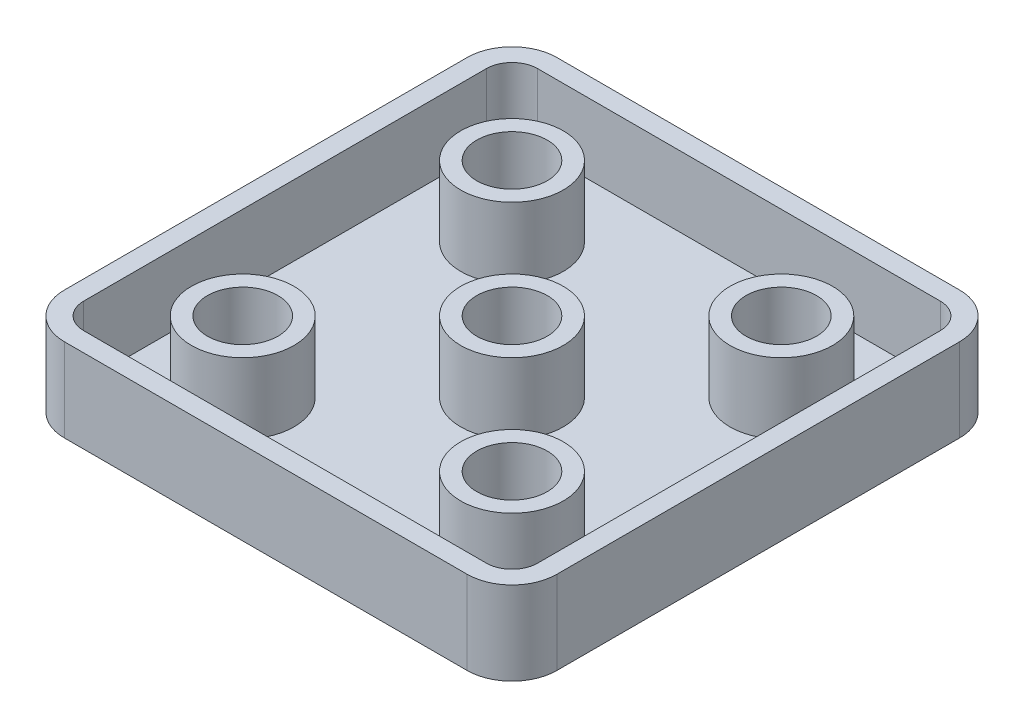
ISO-10303-21;
HEADER;
FILE_DESCRIPTION(('STEP AP214'),'2;1');
FILE_NAME('part.step','',(''),(''),'','','');
FILE_SCHEMA(('AUTOMOTIVE_DESIGN { 1 0 10303 214 1 1 1 1 }'));
ENDSEC;
DATA;
#1=APPLICATION_CONTEXT('core data for automotive mechanical design processes');
#2=APPLICATION_PROTOCOL_DEFINITION('international standard','automotive_design',2000,#1);
#3=PRODUCT_CONTEXT('',#1,'mechanical');
#4=PRODUCT('Part','Part','',(#3));
#5=PRODUCT_RELATED_PRODUCT_CATEGORY('part','',(#4));
#6=PRODUCT_DEFINITION_FORMATION('','',#4);
#7=PRODUCT_DEFINITION_CONTEXT('part definition',#1,'design');
#8=PRODUCT_DEFINITION('design','',#6,#7);
#9=PRODUCT_DEFINITION_SHAPE('','',#8);
#10=(LENGTH_UNIT() NAMED_UNIT(*) SI_UNIT(.MILLI.,.METRE.));
#11=(NAMED_UNIT(*) PLANE_ANGLE_UNIT() SI_UNIT($,.RADIAN.));
#12=(NAMED_UNIT(*) SI_UNIT($,.STERADIAN.) SOLID_ANGLE_UNIT());
#13=UNCERTAINTY_MEASURE_WITH_UNIT(LENGTH_MEASURE(1.E-05),#10,'distance_accuracy_value','');
#14=(GEOMETRIC_REPRESENTATION_CONTEXT(3) GLOBAL_UNCERTAINTY_ASSIGNED_CONTEXT((#13)) GLOBAL_UNIT_ASSIGNED_CONTEXT((#10,
#11,#12)) REPRESENTATION_CONTEXT('',''));
#15=CARTESIAN_POINT('',(0.,0.,0.));
#16=DIRECTION('',(0.,0.,1.));
#17=DIRECTION('',(1.,0.,0.));
#18=AXIS2_PLACEMENT_3D('',#15,#16,#17);
#19=CARTESIAN_POINT('',(0.,6.5,0.));
#20=DIRECTION('',(-1.,0.,0.));
#21=DIRECTION('',(0.,0.,1.));
#22=AXIS2_PLACEMENT_3D('',#19,#20,#21);
#23=PLANE('',#22);
#24=DIRECTION('',(0.,0.,-1.));
#25=VECTOR('',#24,1.);
#26=CARTESIAN_POINT('',(0.,0.,0.));
#27=LINE('',#26,#25);
#28=CARTESIAN_POINT('',(0.,0.,34.9));
#29=VERTEX_POINT('',#28);
#30=CARTESIAN_POINT('',(0.,0.,3.5));
#31=VERTEX_POINT('',#30);
#32=EDGE_CURVE('E369',#29,#31,#27,.T.);
#33=ORIENTED_EDGE('',*,*,#32,.T.);
#34=DIRECTION('',(0.,-1.,0.));
#35=VECTOR('',#34,1.);
#36=CARTESIAN_POINT('',(0.,6.5,3.5));
#37=LINE('',#36,#35);
#38=CARTESIAN_POINT('',(0.,6.5,3.5));
#39=VERTEX_POINT('',#38);
#40=EDGE_CURVE('E12',#31,#39,#37,.F.);
#41=ORIENTED_EDGE('',*,*,#40,.T.);
#42=DIRECTION('',(0.,0.,-1.));
#43=VECTOR('',#42,1.);
#44=CARTESIAN_POINT('',(0.,6.5,0.));
#45=LINE('',#44,#43);
#46=CARTESIAN_POINT('',(0.,6.5,34.9));
#47=VERTEX_POINT('',#46);
#48=EDGE_CURVE('E383',#47,#39,#45,.T.);
#49=ORIENTED_EDGE('',*,*,#48,.F.);
#50=DIRECTION('',(0.,-1.,0.));
#51=VECTOR('',#50,1.);
#52=CARTESIAN_POINT('',(0.,6.5,34.9));
#53=LINE('',#52,#51);
#54=EDGE_CURVE('E183',#47,#29,#53,.T.);
#55=ORIENTED_EDGE('',*,*,#54,.T.);
#56=EDGE_LOOP('',(#33,#41,#49,#55));
#57=FACE_BOUND('',#56,.T.);
#58=ADVANCED_FACE('F175',(#57),#23,.F.);
#59=CARTESIAN_POINT('',(0.,6.5,0.));
#60=DIRECTION('',(0.,0.,1.));
#61=DIRECTION('',(1.,0.,0.));
#62=AXIS2_PLACEMENT_3D('',#59,#60,#61);
#63=PLANE('',#62);
#64=DIRECTION('',(-1.,0.,0.));
#65=VECTOR('',#64,1.);
#66=CARTESIAN_POINT('',(0.,0.,0.));
#67=LINE('',#66,#65);
#68=CARTESIAN_POINT('',(-3.5,0.,0.));
#69=VERTEX_POINT('',#68);
#70=CARTESIAN_POINT('',(-34.9,0.,0.));
#71=VERTEX_POINT('',#70);
#72=EDGE_CURVE('E398',#69,#71,#67,.T.);
#73=ORIENTED_EDGE('',*,*,#72,.T.);
#74=DIRECTION('',(0.,-1.,0.));
#75=VECTOR('',#74,1.);
#76=CARTESIAN_POINT('',(-34.9,6.5,0.));
#77=LINE('',#76,#75);
#78=CARTESIAN_POINT('',(-34.9,6.5,0.));
#79=VERTEX_POINT('',#78);
#80=EDGE_CURVE('E198',#71,#79,#77,.F.);
#81=ORIENTED_EDGE('',*,*,#80,.T.);
#82=DIRECTION('',(-1.,0.,0.));
#83=VECTOR('',#82,1.);
#84=CARTESIAN_POINT('',(0.,6.5,0.));
#85=LINE('',#84,#83);
#86=CARTESIAN_POINT('',(-3.5,6.5,0.));
#87=VERTEX_POINT('',#86);
#88=EDGE_CURVE('E386',#87,#79,#85,.T.);
#89=ORIENTED_EDGE('',*,*,#88,.F.);
#90=DIRECTION('',(0.,-1.,0.));
#91=VECTOR('',#90,1.);
#92=CARTESIAN_POINT('',(-3.5,6.5,0.));
#93=LINE('',#92,#91);
#94=EDGE_CURVE('E430',#87,#69,#93,.T.);
#95=ORIENTED_EDGE('',*,*,#94,.T.);
#96=EDGE_LOOP('',(#73,#81,#89,#95));
#97=FACE_BOUND('',#96,.T.);
#98=ADVANCED_FACE('F449',(#97),#63,.F.);
#99=CARTESIAN_POINT('',(-38.4,6.5,0.));
#100=DIRECTION('',(1.,0.,0.));
#101=DIRECTION('',(0.,0.,-1.));
#102=AXIS2_PLACEMENT_3D('',#99,#100,#101);
#103=PLANE('',#102);
#104=DIRECTION('',(0.,0.,1.));
#105=VECTOR('',#104,1.);
#106=CARTESIAN_POINT('',(-38.4,0.,0.));
#107=LINE('',#106,#105);
#108=CARTESIAN_POINT('',(-38.4,0.,3.5));
#109=VERTEX_POINT('',#108);
#110=CARTESIAN_POINT('',(-38.4,0.,34.9));
#111=VERTEX_POINT('',#110);
#112=EDGE_CURVE('E400',#109,#111,#107,.T.);
#113=ORIENTED_EDGE('',*,*,#112,.T.);
#114=DIRECTION('',(0.,-1.,0.));
#115=VECTOR('',#114,1.);
#116=CARTESIAN_POINT('',(-38.4,6.5,34.9));
#117=LINE('',#116,#115);
#118=CARTESIAN_POINT('',(-38.4,6.5,34.9));
#119=VERTEX_POINT('',#118);
#120=EDGE_CURVE('E420',#111,#119,#117,.F.);
#121=ORIENTED_EDGE('',*,*,#120,.T.);
#122=DIRECTION('',(0.,0.,1.));
#123=VECTOR('',#122,1.);
#124=CARTESIAN_POINT('',(-38.4,6.5,0.));
#125=LINE('',#124,#123);
#126=CARTESIAN_POINT('',(-38.4,6.5,3.5));
#127=VERTEX_POINT('',#126);
#128=EDGE_CURVE('E389',#127,#119,#125,.T.);
#129=ORIENTED_EDGE('',*,*,#128,.F.);
#130=DIRECTION('',(0.,-1.,0.));
#131=VECTOR('',#130,1.);
#132=CARTESIAN_POINT('',(-38.4,6.5,3.5));
#133=LINE('',#132,#131);
#134=EDGE_CURVE('E417',#127,#109,#133,.T.);
#135=ORIENTED_EDGE('',*,*,#134,.T.);
#136=EDGE_LOOP('',(#113,#121,#129,#135));
#137=FACE_BOUND('',#136,.T.);
#138=ADVANCED_FACE('F459',(#137),#103,.F.);
#139=CARTESIAN_POINT('',(0.,6.5,38.4));
#140=DIRECTION('',(0.,0.,-1.));
#141=DIRECTION('',(-1.,0.,0.));
#142=AXIS2_PLACEMENT_3D('',#139,#140,#141);
#143=PLANE('',#142);
#144=DIRECTION('',(1.,0.,0.));
#145=VECTOR('',#144,1.);
#146=CARTESIAN_POINT('',(0.,6.5,38.4));
#147=LINE('',#146,#145);
#148=CARTESIAN_POINT('',(-34.9,6.5,38.4));
#149=VERTEX_POINT('',#148);
#150=CARTESIAN_POINT('',(-3.49999999999999,6.5,38.4));
#151=VERTEX_POINT('',#150);
#152=EDGE_CURVE('E392',#149,#151,#147,.T.);
#153=ORIENTED_EDGE('',*,*,#152,.F.);
#154=DIRECTION('',(0.,-1.,0.));
#155=VECTOR('',#154,1.);
#156=CARTESIAN_POINT('',(-34.9,6.5,38.4));
#157=LINE('',#156,#155);
#158=CARTESIAN_POINT('',(-34.9,0.,38.4));
#159=VERTEX_POINT('',#158);
#160=EDGE_CURVE('E406',#149,#159,#157,.T.);
#161=ORIENTED_EDGE('',*,*,#160,.T.);
#162=DIRECTION('',(1.,0.,0.));
#163=VECTOR('',#162,1.);
#164=CARTESIAN_POINT('',(0.,0.,38.4));
#165=LINE('',#164,#163);
#166=CARTESIAN_POINT('',(-3.49999999999999,0.,38.4));
#167=VERTEX_POINT('',#166);
#168=EDGE_CURVE('E387',#159,#167,#165,.T.);
#169=ORIENTED_EDGE('',*,*,#168,.T.);
#170=DIRECTION('',(0.,-1.,0.));
#171=VECTOR('',#170,1.);
#172=CARTESIAN_POINT('',(-3.49999999999999,6.5,38.4));
#173=LINE('',#172,#171);
#174=EDGE_CURVE('E395',#167,#151,#173,.F.);
#175=ORIENTED_EDGE('',*,*,#174,.T.);
#176=EDGE_LOOP('',(#153,#161,#169,#175));
#177=FACE_BOUND('',#176,.T.);
#178=ADVANCED_FACE('F467',(#177),#143,.F.);
#179=CARTESIAN_POINT('',(0.,6.5,0.));
#180=DIRECTION('',(0.,-1.,0.));
#181=DIRECTION('',(0.,0.,-1.));
#182=AXIS2_PLACEMENT_3D('',#179,#180,#181);
#183=PLANE('',#182);
#184=CARTESIAN_POINT('',(-34.9,6.5,3.5));
#185=DIRECTION('',(0.,1.,0.));
#186=DIRECTION('',(0.,0.,1.));
#187=AXIS2_PLACEMENT_3D('',#184,#185,#186);
#188=CIRCLE('',#187,2.);
#189=CARTESIAN_POINT('',(-34.9,6.5,1.5));
#190=VERTEX_POINT('',#189);
#191=CARTESIAN_POINT('',(-36.9,6.5,3.5));
#192=VERTEX_POINT('',#191);
#193=EDGE_CURVE('E346',#190,#192,#188,.T.);
#194=ORIENTED_EDGE('',*,*,#193,.F.);
#195=DIRECTION('',(-1.,0.,0.));
#196=VECTOR('',#195,1.);
#197=CARTESIAN_POINT('',(0.,6.5,1.5));
#198=LINE('',#197,#196);
#199=CARTESIAN_POINT('',(-3.50000000000001,6.5,1.5));
#200=VERTEX_POINT('',#199);
#201=EDGE_CURVE('E190',#200,#190,#198,.T.);
#202=ORIENTED_EDGE('',*,*,#201,.F.);
#203=CARTESIAN_POINT('',(-3.5,6.5,3.5));
#204=DIRECTION('',(0.,1.,0.));
#205=DIRECTION('',(0.,0.,1.));
#206=AXIS2_PLACEMENT_3D('',#203,#204,#205);
#207=CIRCLE('',#206,2.);
#208=CARTESIAN_POINT('',(-1.5,6.5,3.50000000000001));
#209=VERTEX_POINT('',#208);
#210=EDGE_CURVE('E363',#209,#200,#207,.T.);
#211=ORIENTED_EDGE('',*,*,#210,.F.);
#212=DIRECTION('',(0.,0.,-1.));
#213=VECTOR('',#212,1.);
#214=CARTESIAN_POINT('',(-1.5,6.5,0.));
#215=LINE('',#214,#213);
#216=CARTESIAN_POINT('',(-1.5,6.5,34.9));
#217=VERTEX_POINT('',#216);
#218=EDGE_CURVE('E360',#217,#209,#215,.T.);
#219=ORIENTED_EDGE('',*,*,#218,.F.);
#220=CARTESIAN_POINT('',(-3.5,6.5,34.9));
#221=DIRECTION('',(0.,1.,0.));
#222=DIRECTION('',(0.,0.,1.));
#223=AXIS2_PLACEMENT_3D('',#220,#221,#222);
#224=CIRCLE('',#223,2.);
#225=CARTESIAN_POINT('',(-3.5,6.5,36.9));
#226=VERTEX_POINT('',#225);
#227=EDGE_CURVE('E357',#226,#217,#224,.T.);
#228=ORIENTED_EDGE('',*,*,#227,.F.);
#229=DIRECTION('',(-1.,0.,0.));
#230=VECTOR('',#229,1.);
#231=CARTESIAN_POINT('',(0.,6.5,36.9));
#232=LINE('',#231,#230);
#233=CARTESIAN_POINT('',(-34.9,6.5,36.9));
#234=VERTEX_POINT('',#233);
#235=EDGE_CURVE('E354',#226,#234,#232,.T.);
#236=ORIENTED_EDGE('',*,*,#235,.T.);
#237=CARTESIAN_POINT('',(-34.9,6.5,34.9));
#238=DIRECTION('',(0.,1.,0.));
#239=DIRECTION('',(0.,0.,1.));
#240=AXIS2_PLACEMENT_3D('',#237,#238,#239);
#241=CIRCLE('',#240,2.);
#242=CARTESIAN_POINT('',(-36.9,6.5,34.9));
#243=VERTEX_POINT('',#242);
#244=EDGE_CURVE('E351',#234,#243,#241,.F.);
#245=ORIENTED_EDGE('',*,*,#244,.T.);
#246=DIRECTION('',(0.,0.,-1.));
#247=VECTOR('',#246,1.);
#248=CARTESIAN_POINT('',(-36.9,6.5,0.));
#249=LINE('',#248,#247);
#250=EDGE_CURVE('E348',#243,#192,#249,.T.);
#251=ORIENTED_EDGE('',*,*,#250,.T.);
#252=EDGE_LOOP('',(#194,#202,#211,#219,#228,#236,#245,#251));
#253=FACE_BOUND('',#252,.T.);
#254=ORIENTED_EDGE('',*,*,#128,.T.);
#255=CARTESIAN_POINT('',(-34.9,6.5,34.9));
#256=DIRECTION('',(0.,-1.,0.));
#257=DIRECTION('',(0.,0.,-1.));
#258=AXIS2_PLACEMENT_3D('',#255,#256,#257);
#259=CIRCLE('',#258,3.5);
#260=EDGE_CURVE('E428',#119,#149,#259,.F.);
#261=ORIENTED_EDGE('',*,*,#260,.T.);
#262=ORIENTED_EDGE('',*,*,#152,.T.);
#263=CARTESIAN_POINT('',(-3.5,6.5,34.9));
#264=DIRECTION('',(0.,-1.,0.));
#265=DIRECTION('',(0.,0.,-1.));
#266=AXIS2_PLACEMENT_3D('',#263,#264,#265);
#267=CIRCLE('',#266,3.5);
#268=EDGE_CURVE('E422',#151,#47,#267,.F.);
#269=ORIENTED_EDGE('',*,*,#268,.T.);
#270=ORIENTED_EDGE('',*,*,#48,.T.);
#271=CARTESIAN_POINT('',(-3.5,6.5,3.5));
#272=DIRECTION('',(0.,-1.,0.));
#273=DIRECTION('',(0.,0.,-1.));
#274=AXIS2_PLACEMENT_3D('',#271,#272,#273);
#275=CIRCLE('',#274,3.5);
#276=EDGE_CURVE('E424',#39,#87,#275,.F.);
#277=ORIENTED_EDGE('',*,*,#276,.T.);
#278=ORIENTED_EDGE('',*,*,#88,.T.);
#279=CARTESIAN_POINT('',(-34.9,6.5,3.5));
#280=DIRECTION('',(0.,-1.,0.));
#281=DIRECTION('',(0.,0.,-1.));
#282=AXIS2_PLACEMENT_3D('',#279,#280,#281);
#283=CIRCLE('',#282,3.5);
#284=EDGE_CURVE('E426',#79,#127,#283,.F.);
#285=ORIENTED_EDGE('',*,*,#284,.T.);
#286=EDGE_LOOP('',(#254,#261,#262,#269,#270,#277,#278,#285));
#287=FACE_BOUND('',#286,.T.);
#288=ADVANCED_FACE('F452',(#253,#287),#183,.F.);
#289=CARTESIAN_POINT('',(0.,0.,0.));
#290=DIRECTION('',(0.,-1.,0.));
#291=DIRECTION('',(0.,0.,-1.));
#292=AXIS2_PLACEMENT_3D('',#289,#290,#291);
#293=PLANE('',#292);
#294=ORIENTED_EDGE('',*,*,#168,.F.);
#295=CARTESIAN_POINT('',(-34.9,0.,34.9));
#296=DIRECTION('',(0.,-1.,0.));
#297=DIRECTION('',(0.,0.,-1.));
#298=AXIS2_PLACEMENT_3D('',#295,#296,#297);
#299=CIRCLE('',#298,3.5);
#300=EDGE_CURVE('E415',#159,#111,#299,.T.);
#301=ORIENTED_EDGE('',*,*,#300,.T.);
#302=ORIENTED_EDGE('',*,*,#112,.F.);
#303=CARTESIAN_POINT('',(-34.9,0.,3.5));
#304=DIRECTION('',(0.,-1.,0.));
#305=DIRECTION('',(0.,0.,-1.));
#306=AXIS2_PLACEMENT_3D('',#303,#304,#305);
#307=CIRCLE('',#306,3.5);
#308=EDGE_CURVE('E413',#109,#71,#307,.T.);
#309=ORIENTED_EDGE('',*,*,#308,.T.);
#310=ORIENTED_EDGE('',*,*,#72,.F.);
#311=CARTESIAN_POINT('',(-3.5,0.,3.5));
#312=DIRECTION('',(0.,-1.,0.));
#313=DIRECTION('',(0.,0.,-1.));
#314=AXIS2_PLACEMENT_3D('',#311,#312,#313);
#315=CIRCLE('',#314,3.5);
#316=EDGE_CURVE('E411',#69,#31,#315,.T.);
#317=ORIENTED_EDGE('',*,*,#316,.T.);
#318=ORIENTED_EDGE('',*,*,#32,.F.);
#319=CARTESIAN_POINT('',(-3.5,0.,34.9));
#320=DIRECTION('',(0.,-1.,0.));
#321=DIRECTION('',(0.,0.,-1.));
#322=AXIS2_PLACEMENT_3D('',#319,#320,#321);
#323=CIRCLE('',#322,3.5);
#324=EDGE_CURVE('E409',#29,#167,#323,.T.);
#325=ORIENTED_EDGE('',*,*,#324,.T.);
#326=EDGE_LOOP('',(#294,#301,#302,#309,#310,#317,#318,#325));
#327=FACE_BOUND('',#326,.T.);
#328=ADVANCED_FACE('F443',(#327),#293,.T.);
#329=CARTESIAN_POINT('',(-34.9,6.5,34.9));
#330=DIRECTION('',(0.,-1.,0.));
#331=DIRECTION('',(0.,0.,-1.));
#332=AXIS2_PLACEMENT_3D('',#329,#330,#331);
#333=CYLINDRICAL_SURFACE('',#332,3.5);
#334=ORIENTED_EDGE('',*,*,#260,.F.);
#335=ORIENTED_EDGE('',*,*,#120,.F.);
#336=ORIENTED_EDGE('',*,*,#300,.F.);
#337=ORIENTED_EDGE('',*,*,#160,.F.);
#338=EDGE_LOOP('',(#334,#335,#336,#337));
#339=FACE_BOUND('',#338,.T.);
#340=ADVANCED_FACE('F464',(#339),#333,.T.);
#341=CARTESIAN_POINT('',(-34.9,6.5,3.5));
#342=DIRECTION('',(0.,-1.,0.));
#343=DIRECTION('',(0.,0.,-1.));
#344=AXIS2_PLACEMENT_3D('',#341,#342,#343);
#345=CYLINDRICAL_SURFACE('',#344,3.5);
#346=ORIENTED_EDGE('',*,*,#284,.F.);
#347=ORIENTED_EDGE('',*,*,#80,.F.);
#348=ORIENTED_EDGE('',*,*,#308,.F.);
#349=ORIENTED_EDGE('',*,*,#134,.F.);
#350=EDGE_LOOP('',(#346,#347,#348,#349));
#351=FACE_BOUND('',#350,.T.);
#352=ADVANCED_FACE('F456',(#351),#345,.T.);
#353=CARTESIAN_POINT('',(-3.5,6.5,3.5));
#354=DIRECTION('',(0.,-1.,0.));
#355=DIRECTION('',(0.,0.,-1.));
#356=AXIS2_PLACEMENT_3D('',#353,#354,#355);
#357=CYLINDRICAL_SURFACE('',#356,3.5);
#358=ORIENTED_EDGE('',*,*,#276,.F.);
#359=ORIENTED_EDGE('',*,*,#40,.F.);
#360=ORIENTED_EDGE('',*,*,#316,.F.);
#361=ORIENTED_EDGE('',*,*,#94,.F.);
#362=EDGE_LOOP('',(#358,#359,#360,#361));
#363=FACE_BOUND('',#362,.T.);
#364=ADVANCED_FACE('F448',(#363),#357,.T.);
#365=CARTESIAN_POINT('',(-3.5,6.5,34.9));
#366=DIRECTION('',(0.,-1.,0.));
#367=DIRECTION('',(0.,0.,-1.));
#368=AXIS2_PLACEMENT_3D('',#365,#366,#367);
#369=CYLINDRICAL_SURFACE('',#368,3.5);
#370=ORIENTED_EDGE('',*,*,#268,.F.);
#371=ORIENTED_EDGE('',*,*,#174,.F.);
#372=ORIENTED_EDGE('',*,*,#324,.F.);
#373=ORIENTED_EDGE('',*,*,#54,.F.);
#374=EDGE_LOOP('',(#370,#371,#372,#373));
#375=FACE_BOUND('',#374,.T.);
#376=ADVANCED_FACE('F177',(#375),#369,.T.);
#377=CARTESIAN_POINT('',(0.,1.,1.5));
#378=DIRECTION('',(0.,0.,-1.));
#379=DIRECTION('',(-1.,0.,0.));
#380=AXIS2_PLACEMENT_3D('',#377,#378,#379);
#381=PLANE('',#380);
#382=ORIENTED_EDGE('',*,*,#201,.T.);
#383=DIRECTION('',(0.,1.,0.));
#384=VECTOR('',#383,1.);
#385=CARTESIAN_POINT('',(-34.9,1.,1.5));
#386=LINE('',#385,#384);
#387=CARTESIAN_POINT('',(-34.9,1.,1.5));
#388=VERTEX_POINT('',#387);
#389=EDGE_CURVE('E287',#388,#190,#386,.T.);
#390=ORIENTED_EDGE('',*,*,#389,.F.);
#391=DIRECTION('',(-1.,0.,0.));
#392=VECTOR('',#391,1.);
#393=CARTESIAN_POINT('',(0.,1.,1.5));
#394=LINE('',#393,#392);
#395=CARTESIAN_POINT('',(-3.50000000000001,1.,1.5));
#396=VERTEX_POINT('',#395);
#397=EDGE_CURVE('E291',#396,#388,#394,.T.);
#398=ORIENTED_EDGE('',*,*,#397,.F.);
#399=DIRECTION('',(0.,1.,0.));
#400=VECTOR('',#399,1.);
#401=CARTESIAN_POINT('',(-3.50000000000001,1.,1.5));
#402=LINE('',#401,#400);
#403=EDGE_CURVE('E367',#396,#200,#402,.T.);
#404=ORIENTED_EDGE('',*,*,#403,.T.);
#405=EDGE_LOOP('',(#382,#390,#398,#404));
#406=FACE_BOUND('',#405,.T.);
#407=ADVANCED_FACE('F289',(#406),#381,.F.);
#408=CARTESIAN_POINT('',(-3.5,1.,3.5));
#409=DIRECTION('',(0.,1.,0.));
#410=DIRECTION('',(0.,0.,1.));
#411=AXIS2_PLACEMENT_3D('',#408,#409,#410);
#412=CYLINDRICAL_SURFACE('',#411,2.);
#413=ORIENTED_EDGE('',*,*,#210,.T.);
#414=ORIENTED_EDGE('',*,*,#403,.F.);
#415=CARTESIAN_POINT('',(-3.5,1.,3.5));
#416=DIRECTION('',(0.,1.,0.));
#417=DIRECTION('',(0.,0.,1.));
#418=AXIS2_PLACEMENT_3D('',#415,#416,#417);
#419=CIRCLE('',#418,2.);
#420=CARTESIAN_POINT('',(-1.5,1.,3.50000000000001));
#421=VERTEX_POINT('',#420);
#422=EDGE_CURVE('E297',#421,#396,#419,.T.);
#423=ORIENTED_EDGE('',*,*,#422,.F.);
#424=DIRECTION('',(0.,1.,0.));
#425=VECTOR('',#424,1.);
#426=CARTESIAN_POINT('',(-1.5,1.,3.50000000000001));
#427=LINE('',#426,#425);
#428=EDGE_CURVE('E370',#421,#209,#427,.T.);
#429=ORIENTED_EDGE('',*,*,#428,.T.);
#430=EDGE_LOOP('',(#413,#414,#423,#429));
#431=FACE_BOUND('',#430,.T.);
#432=ADVANCED_FACE('F474',(#431),#412,.F.);
#433=CARTESIAN_POINT('',(-1.5,1.,0.));
#434=DIRECTION('',(1.,0.,0.));
#435=DIRECTION('',(0.,0.,-1.));
#436=AXIS2_PLACEMENT_3D('',#433,#434,#435);
#437=PLANE('',#436);
#438=ORIENTED_EDGE('',*,*,#218,.T.);
#439=ORIENTED_EDGE('',*,*,#428,.F.);
#440=DIRECTION('',(0.,0.,-1.));
#441=VECTOR('',#440,1.);
#442=CARTESIAN_POINT('',(-1.5,1.,0.));
#443=LINE('',#442,#441);
#444=CARTESIAN_POINT('',(-1.5,1.,34.9));
#445=VERTEX_POINT('',#444);
#446=EDGE_CURVE('E326',#445,#421,#443,.T.);
#447=ORIENTED_EDGE('',*,*,#446,.F.);
#448=DIRECTION('',(0.,1.,0.));
#449=VECTOR('',#448,1.);
#450=CARTESIAN_POINT('',(-1.5,1.,34.9));
#451=LINE('',#450,#449);
#452=EDGE_CURVE('E372',#445,#217,#451,.T.);
#453=ORIENTED_EDGE('',*,*,#452,.T.);
#454=EDGE_LOOP('',(#438,#439,#447,#453));
#455=FACE_BOUND('',#454,.T.);
#456=ADVANCED_FACE('F516',(#455),#437,.F.);
#457=CARTESIAN_POINT('',(-3.5,1.,34.9));
#458=DIRECTION('',(0.,1.,0.));
#459=DIRECTION('',(0.,0.,1.));
#460=AXIS2_PLACEMENT_3D('',#457,#458,#459);
#461=CYLINDRICAL_SURFACE('',#460,2.);
#462=ORIENTED_EDGE('',*,*,#227,.T.);
#463=ORIENTED_EDGE('',*,*,#452,.F.);
#464=CARTESIAN_POINT('',(-3.5,1.,34.9));
#465=DIRECTION('',(0.,1.,0.));
#466=DIRECTION('',(0.,0.,1.));
#467=AXIS2_PLACEMENT_3D('',#464,#465,#466);
#468=CIRCLE('',#467,2.);
#469=CARTESIAN_POINT('',(-3.5,1.,36.9));
#470=VERTEX_POINT('',#469);
#471=EDGE_CURVE('E323',#470,#445,#468,.T.);
#472=ORIENTED_EDGE('',*,*,#471,.F.);
#473=DIRECTION('',(0.,1.,0.));
#474=VECTOR('',#473,1.);
#475=CARTESIAN_POINT('',(-3.5,1.,36.9));
#476=LINE('',#475,#474);
#477=EDGE_CURVE('E374',#470,#226,#476,.T.);
#478=ORIENTED_EDGE('',*,*,#477,.T.);
#479=EDGE_LOOP('',(#462,#463,#472,#478));
#480=FACE_BOUND('',#479,.T.);
#481=ADVANCED_FACE('F526',(#480),#461,.F.);
#482=CARTESIAN_POINT('',(0.,1.,36.9));
#483=DIRECTION('',(0.,0.,-1.));
#484=DIRECTION('',(-1.,0.,0.));
#485=AXIS2_PLACEMENT_3D('',#482,#483,#484);
#486=PLANE('',#485);
#487=ORIENTED_EDGE('',*,*,#235,.F.);
#488=ORIENTED_EDGE('',*,*,#477,.F.);
#489=DIRECTION('',(-1.,0.,0.));
#490=VECTOR('',#489,1.);
#491=CARTESIAN_POINT('',(0.,1.,36.9));
#492=LINE('',#491,#490);
#493=CARTESIAN_POINT('',(-34.9,1.,36.9));
#494=VERTEX_POINT('',#493);
#495=EDGE_CURVE('E320',#470,#494,#492,.T.);
#496=ORIENTED_EDGE('',*,*,#495,.T.);
#497=DIRECTION('',(0.,1.,0.));
#498=VECTOR('',#497,1.);
#499=CARTESIAN_POINT('',(-34.9,1.,36.9));
#500=LINE('',#499,#498);
#501=EDGE_CURVE('E376',#494,#234,#500,.T.);
#502=ORIENTED_EDGE('',*,*,#501,.T.);
#503=EDGE_LOOP('',(#487,#488,#496,#502));
#504=FACE_BOUND('',#503,.T.);
#505=ADVANCED_FACE('F536',(#504),#486,.T.);
#506=CARTESIAN_POINT('',(-34.9,1.,34.9));
#507=DIRECTION('',(0.,1.,0.));
#508=DIRECTION('',(0.,0.,1.));
#509=AXIS2_PLACEMENT_3D('',#506,#507,#508);
#510=CYLINDRICAL_SURFACE('',#509,2.);
#511=ORIENTED_EDGE('',*,*,#244,.F.);
#512=ORIENTED_EDGE('',*,*,#501,.F.);
#513=CARTESIAN_POINT('',(-34.9,1.,34.9));
#514=DIRECTION('',(0.,1.,0.));
#515=DIRECTION('',(0.,0.,1.));
#516=AXIS2_PLACEMENT_3D('',#513,#514,#515);
#517=CIRCLE('',#516,2.);
#518=CARTESIAN_POINT('',(-36.9,1.,34.9));
#519=VERTEX_POINT('',#518);
#520=EDGE_CURVE('E317',#494,#519,#517,.F.);
#521=ORIENTED_EDGE('',*,*,#520,.T.);
#522=DIRECTION('',(0.,1.,0.));
#523=VECTOR('',#522,1.);
#524=CARTESIAN_POINT('',(-36.9,1.,34.9));
#525=LINE('',#524,#523);
#526=EDGE_CURVE('E379',#519,#243,#525,.T.);
#527=ORIENTED_EDGE('',*,*,#526,.T.);
#528=EDGE_LOOP('',(#511,#512,#521,#527));
#529=FACE_BOUND('',#528,.T.);
#530=ADVANCED_FACE('F546',(#529),#510,.F.);
#531=CARTESIAN_POINT('',(-36.9,1.,0.));
#532=DIRECTION('',(1.,0.,0.));
#533=DIRECTION('',(0.,0.,-1.));
#534=AXIS2_PLACEMENT_3D('',#531,#532,#533);
#535=PLANE('',#534);
#536=ORIENTED_EDGE('',*,*,#250,.F.);
#537=ORIENTED_EDGE('',*,*,#526,.F.);
#538=DIRECTION('',(0.,0.,-1.));
#539=VECTOR('',#538,1.);
#540=CARTESIAN_POINT('',(-36.9,1.,0.));
#541=LINE('',#540,#539);
#542=CARTESIAN_POINT('',(-36.9,1.,3.5));
#543=VERTEX_POINT('',#542);
#544=EDGE_CURVE('E304',#519,#543,#541,.T.);
#545=ORIENTED_EDGE('',*,*,#544,.T.);
#546=DIRECTION('',(0.,1.,0.));
#547=VECTOR('',#546,1.);
#548=CARTESIAN_POINT('',(-36.9,1.,3.5));
#549=LINE('',#548,#547);
#550=EDGE_CURVE('E296',#543,#192,#549,.T.);
#551=ORIENTED_EDGE('',*,*,#550,.T.);
#552=EDGE_LOOP('',(#536,#537,#545,#551));
#553=FACE_BOUND('',#552,.T.);
#554=ADVANCED_FACE('F556',(#553),#535,.T.);
#555=CARTESIAN_POINT('',(-29.7,1.,8.7));
#556=DIRECTION('',(0.,1.,0.));
#557=DIRECTION('',(0.,0.,1.));
#558=AXIS2_PLACEMENT_3D('',#555,#556,#557);
#559=CYLINDRICAL_SURFACE('',#558,4.);
#560=CARTESIAN_POINT('',(-29.7,1.,8.7));
#561=DIRECTION('',(0.,1.,0.));
#562=DIRECTION('',(0.,0.,1.));
#563=AXIS2_PLACEMENT_3D('',#560,#561,#562);
#564=CIRCLE('',#563,4.);
#565=CARTESIAN_POINT('',(-29.7,1.,12.7));
#566=VERTEX_POINT('',#565);
#567=EDGE_CURVE('E309',#566,#566,#564,.T.);
#568=ORIENTED_EDGE('',*,*,#567,.T.);
#569=EDGE_LOOP('',(#568));
#570=FACE_BOUND('',#569,.T.);
#571=CARTESIAN_POINT('',(-29.7,6.5,8.7));
#572=DIRECTION('',(0.,1.,0.));
#573=DIRECTION('',(0.,0.,1.));
#574=AXIS2_PLACEMENT_3D('',#571,#572,#573);
#575=CIRCLE('',#574,4.);
#576=CARTESIAN_POINT('',(-29.7,6.5,12.7));
#577=VERTEX_POINT('',#576);
#578=EDGE_CURVE('E342',#577,#577,#575,.T.);
#579=ORIENTED_EDGE('',*,*,#578,.F.);
#580=EDGE_LOOP('',(#579));
#581=FACE_BOUND('',#580,.T.);
#582=ADVANCED_FACE('F566',(#570,#581),#559,.T.);
#583=CARTESIAN_POINT('',(-8.7,1.,8.7));
#584=DIRECTION('',(0.,1.,0.));
#585=DIRECTION('',(0.,0.,1.));
#586=AXIS2_PLACEMENT_3D('',#583,#584,#585);
#587=CYLINDRICAL_SURFACE('',#586,4.);
#588=CARTESIAN_POINT('',(-8.7,1.,8.7));
#589=DIRECTION('',(0.,1.,0.));
#590=DIRECTION('',(0.,0.,1.));
#591=AXIS2_PLACEMENT_3D('',#588,#589,#590);
#592=CIRCLE('',#591,4.);
#593=CARTESIAN_POINT('',(-8.7,1.,12.7));
#594=VERTEX_POINT('',#593);
#595=EDGE_CURVE('E312',#594,#594,#592,.T.);
#596=ORIENTED_EDGE('',*,*,#595,.T.);
#597=EDGE_LOOP('',(#596));
#598=FACE_BOUND('',#597,.T.);
#599=CARTESIAN_POINT('',(-8.7,6.5,8.7));
#600=DIRECTION('',(0.,1.,0.));
#601=DIRECTION('',(0.,0.,1.));
#602=AXIS2_PLACEMENT_3D('',#599,#600,#601);
#603=CIRCLE('',#602,4.);
#604=CARTESIAN_POINT('',(-8.7,6.5,12.7));
#605=VERTEX_POINT('',#604);
#606=EDGE_CURVE('E339',#605,#605,#603,.T.);
#607=ORIENTED_EDGE('',*,*,#606,.F.);
#608=EDGE_LOOP('',(#607));
#609=FACE_BOUND('',#608,.T.);
#610=ADVANCED_FACE('F576',(#598,#609),#587,.T.);
#611=CARTESIAN_POINT('',(-8.7,1.,29.7));
#612=DIRECTION('',(0.,1.,0.));
#613=DIRECTION('',(0.,0.,1.));
#614=AXIS2_PLACEMENT_3D('',#611,#612,#613);
#615=CYLINDRICAL_SURFACE('',#614,4.);
#616=CARTESIAN_POINT('',(-8.7,1.,29.7));
#617=DIRECTION('',(0.,1.,0.));
#618=DIRECTION('',(0.,0.,1.));
#619=AXIS2_PLACEMENT_3D('',#616,#617,#618);
#620=CIRCLE('',#619,4.);
#621=CARTESIAN_POINT('',(-8.7,1.,33.7));
#622=VERTEX_POINT('',#621);
#623=EDGE_CURVE('E1045',#622,#622,#620,.T.);
#624=ORIENTED_EDGE('',*,*,#623,.T.);
#625=EDGE_LOOP('',(#624));
#626=FACE_BOUND('',#625,.T.);
#627=CARTESIAN_POINT('',(-8.7,6.5,29.7));
#628=DIRECTION('',(0.,1.,0.));
#629=DIRECTION('',(0.,0.,1.));
#630=AXIS2_PLACEMENT_3D('',#627,#628,#629);
#631=CIRCLE('',#630,4.);
#632=CARTESIAN_POINT('',(-8.7,6.5,33.7));
#633=VERTEX_POINT('',#632);
#634=EDGE_CURVE('E336',#633,#633,#631,.T.);
#635=ORIENTED_EDGE('',*,*,#634,.F.);
#636=EDGE_LOOP('',(#635));
#637=FACE_BOUND('',#636,.T.);
#638=ADVANCED_FACE('F586',(#626,#637),#615,.T.);
#639=CARTESIAN_POINT('',(-29.7,1.,29.7));
#640=DIRECTION('',(0.,1.,0.));
#641=DIRECTION('',(0.,0.,1.));
#642=AXIS2_PLACEMENT_3D('',#639,#640,#641);
#643=CYLINDRICAL_SURFACE('',#642,4.);
#644=CARTESIAN_POINT('',(-29.7,1.,29.7));
#645=DIRECTION('',(0.,1.,0.));
#646=DIRECTION('',(0.,0.,1.));
#647=AXIS2_PLACEMENT_3D('',#644,#645,#646);
#648=CIRCLE('',#647,4.);
#649=CARTESIAN_POINT('',(-29.7,1.,33.7));
#650=VERTEX_POINT('',#649);
#651=EDGE_CURVE('E1042',#650,#650,#648,.T.);
#652=ORIENTED_EDGE('',*,*,#651,.T.);
#653=EDGE_LOOP('',(#652));
#654=FACE_BOUND('',#653,.T.);
#655=CARTESIAN_POINT('',(-29.7,6.5,29.7));
#656=DIRECTION('',(0.,1.,0.));
#657=DIRECTION('',(0.,0.,1.));
#658=AXIS2_PLACEMENT_3D('',#655,#656,#657);
#659=CIRCLE('',#658,4.);
#660=CARTESIAN_POINT('',(-29.7,6.5,33.7));
#661=VERTEX_POINT('',#660);
#662=EDGE_CURVE('E332',#661,#661,#659,.T.);
#663=ORIENTED_EDGE('',*,*,#662,.F.);
#664=EDGE_LOOP('',(#663));
#665=FACE_BOUND('',#664,.T.);
#666=ADVANCED_FACE('F596',(#654,#665),#643,.T.);
#667=CARTESIAN_POINT('',(-19.2,1.,19.2));
#668=DIRECTION('',(0.,1.,0.));
#669=DIRECTION('',(0.,0.,1.));
#670=AXIS2_PLACEMENT_3D('',#667,#668,#669);
#671=CYLINDRICAL_SURFACE('',#670,4.);
#672=CARTESIAN_POINT('',(-19.2,1.,19.2));
#673=DIRECTION('',(0.,1.,0.));
#674=DIRECTION('',(0.,0.,1.));
#675=AXIS2_PLACEMENT_3D('',#672,#673,#674);
#676=CIRCLE('',#675,4.);
#677=CARTESIAN_POINT('',(-19.2,1.,23.2));
#678=VERTEX_POINT('',#677);
#679=EDGE_CURVE('E366',#678,#678,#676,.T.);
#680=ORIENTED_EDGE('',*,*,#679,.T.);
#681=EDGE_LOOP('',(#680));
#682=FACE_BOUND('',#681,.T.);
#683=CARTESIAN_POINT('',(-19.2,6.5,19.2));
#684=DIRECTION('',(0.,1.,0.));
#685=DIRECTION('',(0.,0.,1.));
#686=AXIS2_PLACEMENT_3D('',#683,#684,#685);
#687=CIRCLE('',#686,4.);
#688=CARTESIAN_POINT('',(-19.2,6.5,23.2));
#689=VERTEX_POINT('',#688);
#690=EDGE_CURVE('E329',#689,#689,#687,.T.);
#691=ORIENTED_EDGE('',*,*,#690,.F.);
#692=EDGE_LOOP('',(#691));
#693=FACE_BOUND('',#692,.T.);
#694=ADVANCED_FACE('F606',(#682,#693),#671,.T.);
#695=CARTESIAN_POINT('',(-34.9,1.,3.5));
#696=DIRECTION('',(0.,1.,0.));
#697=DIRECTION('',(0.,0.,1.));
#698=AXIS2_PLACEMENT_3D('',#695,#696,#697);
#699=CYLINDRICAL_SURFACE('',#698,2.);
#700=ORIENTED_EDGE('',*,*,#193,.T.);
#701=ORIENTED_EDGE('',*,*,#550,.F.);
#702=CARTESIAN_POINT('',(-34.9,1.,3.5));
#703=DIRECTION('',(0.,1.,0.));
#704=DIRECTION('',(0.,0.,1.));
#705=AXIS2_PLACEMENT_3D('',#702,#703,#704);
#706=CIRCLE('',#705,2.);
#707=EDGE_CURVE('E301',#388,#543,#706,.T.);
#708=ORIENTED_EDGE('',*,*,#707,.F.);
#709=ORIENTED_EDGE('',*,*,#389,.T.);
#710=EDGE_LOOP('',(#700,#701,#708,#709));
#711=FACE_BOUND('',#710,.T.);
#712=ADVANCED_FACE('F302',(#711),#699,.F.);
#713=CARTESIAN_POINT('',(0.,1.,0.));
#714=DIRECTION('',(0.,1.,0.));
#715=DIRECTION('',(0.,0.,1.));
#716=AXIS2_PLACEMENT_3D('',#713,#714,#715);
#717=PLANE('',#716);
#718=ORIENTED_EDGE('',*,*,#679,.F.);
#719=EDGE_LOOP('',(#718));
#720=FACE_BOUND('',#719,.T.);
#721=ORIENTED_EDGE('',*,*,#651,.F.);
#722=EDGE_LOOP('',(#721));
#723=FACE_BOUND('',#722,.T.);
#724=ORIENTED_EDGE('',*,*,#623,.F.);
#725=EDGE_LOOP('',(#724));
#726=FACE_BOUND('',#725,.T.);
#727=ORIENTED_EDGE('',*,*,#595,.F.);
#728=EDGE_LOOP('',(#727));
#729=FACE_BOUND('',#728,.T.);
#730=ORIENTED_EDGE('',*,*,#567,.F.);
#731=EDGE_LOOP('',(#730));
#732=FACE_BOUND('',#731,.T.);
#733=ORIENTED_EDGE('',*,*,#397,.T.);
#734=ORIENTED_EDGE('',*,*,#707,.T.);
#735=ORIENTED_EDGE('',*,*,#544,.F.);
#736=ORIENTED_EDGE('',*,*,#520,.F.);
#737=ORIENTED_EDGE('',*,*,#495,.F.);
#738=ORIENTED_EDGE('',*,*,#471,.T.);
#739=ORIENTED_EDGE('',*,*,#446,.T.);
#740=ORIENTED_EDGE('',*,*,#422,.T.);
#741=EDGE_LOOP('',(#733,#734,#735,#736,#737,#738,#739,#740));
#742=FACE_BOUND('',#741,.T.);
#743=ADVANCED_FACE('F306',(#720,#723,#726,#729,#732,#742),#717,.T.);
#744=CARTESIAN_POINT('',(-19.2,6.5,19.2));
#745=DIRECTION('',(0.,1.,0.));
#746=DIRECTION('',(0.,0.,1.));
#747=AXIS2_PLACEMENT_3D('',#744,#745,#746);
#748=CIRCLE('',#747,2.75);
#749=CARTESIAN_POINT('',(-19.2,6.5,21.95));
#750=VERTEX_POINT('',#749);
#751=EDGE_CURVE('E1035',#750,#750,#748,.T.);
#752=ORIENTED_EDGE('',*,*,#751,.F.);
#753=EDGE_LOOP('',(#752));
#754=FACE_BOUND('',#753,.T.);
#755=ORIENTED_EDGE('',*,*,#690,.T.);
#756=EDGE_LOOP('',(#755));
#757=FACE_BOUND('',#756,.T.);
#758=ADVANCED_FACE('F633',(#754,#757),#183,.F.);
#759=CARTESIAN_POINT('',(-29.7,6.5,29.7));
#760=DIRECTION('',(0.,1.,0.));
#761=DIRECTION('',(0.,0.,1.));
#762=AXIS2_PLACEMENT_3D('',#759,#760,#761);
#763=CIRCLE('',#762,2.75);
#764=CARTESIAN_POINT('',(-29.7,6.5,32.45));
#765=VERTEX_POINT('',#764);
#766=EDGE_CURVE('E1029',#765,#765,#763,.T.);
#767=ORIENTED_EDGE('',*,*,#766,.F.);
#768=EDGE_LOOP('',(#767));
#769=FACE_BOUND('',#768,.T.);
#770=ORIENTED_EDGE('',*,*,#662,.T.);
#771=EDGE_LOOP('',(#770));
#772=FACE_BOUND('',#771,.T.);
#773=ADVANCED_FACE('F643',(#769,#772),#183,.F.);
#774=CARTESIAN_POINT('',(-8.7,6.5,29.7));
#775=DIRECTION('',(0.,1.,0.));
#776=DIRECTION('',(0.,0.,1.));
#777=AXIS2_PLACEMENT_3D('',#774,#775,#776);
#778=CIRCLE('',#777,2.75);
#779=CARTESIAN_POINT('',(-8.7,6.5,32.45));
#780=VERTEX_POINT('',#779);
#781=EDGE_CURVE('E1016',#780,#780,#778,.T.);
#782=ORIENTED_EDGE('',*,*,#781,.F.);
#783=EDGE_LOOP('',(#782));
#784=FACE_BOUND('',#783,.T.);
#785=ORIENTED_EDGE('',*,*,#634,.T.);
#786=EDGE_LOOP('',(#785));
#787=FACE_BOUND('',#786,.T.);
#788=ADVANCED_FACE('F653',(#784,#787),#183,.F.);
#789=CARTESIAN_POINT('',(-8.7,6.5,8.7));
#790=DIRECTION('',(0.,1.,0.));
#791=DIRECTION('',(0.,0.,1.));
#792=AXIS2_PLACEMENT_3D('',#789,#790,#791);
#793=CIRCLE('',#792,2.75);
#794=CARTESIAN_POINT('',(-8.7,6.5,11.45));
#795=VERTEX_POINT('',#794);
#796=EDGE_CURVE('E1032',#795,#795,#793,.T.);
#797=ORIENTED_EDGE('',*,*,#796,.F.);
#798=EDGE_LOOP('',(#797));
#799=FACE_BOUND('',#798,.T.);
#800=ORIENTED_EDGE('',*,*,#606,.T.);
#801=EDGE_LOOP('',(#800));
#802=FACE_BOUND('',#801,.T.);
#803=ADVANCED_FACE('F662',(#799,#802),#183,.F.);
#804=CARTESIAN_POINT('',(-29.7,6.5,8.7));
#805=DIRECTION('',(0.,1.,0.));
#806=DIRECTION('',(0.,0.,1.));
#807=AXIS2_PLACEMENT_3D('',#804,#805,#806);
#808=CIRCLE('',#807,2.75);
#809=CARTESIAN_POINT('',(-29.7,6.5,11.45));
#810=VERTEX_POINT('',#809);
#811=EDGE_CURVE('E333',#810,#810,#808,.T.);
#812=ORIENTED_EDGE('',*,*,#811,.F.);
#813=EDGE_LOOP('',(#812));
#814=FACE_BOUND('',#813,.T.);
#815=ORIENTED_EDGE('',*,*,#578,.T.);
#816=EDGE_LOOP('',(#815));
#817=FACE_BOUND('',#816,.T.);
#818=ADVANCED_FACE('F671',(#814,#817),#183,.F.);
#819=CARTESIAN_POINT('',(-8.7,1.,29.7));
#820=DIRECTION('',(0.,1.,0.));
#821=DIRECTION('',(0.,0.,1.));
#822=AXIS2_PLACEMENT_3D('',#819,#820,#821);
#823=CYLINDRICAL_SURFACE('',#822,2.75);
#824=ORIENTED_EDGE('',*,*,#781,.T.);
#825=EDGE_LOOP('',(#824));
#826=FACE_BOUND('',#825,.T.);
#827=CARTESIAN_POINT('',(-8.7,0.6,29.7));
#828=DIRECTION('',(0.,1.,0.));
#829=DIRECTION('',(0.,0.,1.));
#830=AXIS2_PLACEMENT_3D('',#827,#828,#829);
#831=CIRCLE('',#830,2.75);
#832=CARTESIAN_POINT('',(-8.7,0.6,32.45));
#833=VERTEX_POINT('',#832);
#834=EDGE_CURVE('E1010',#833,#833,#831,.T.);
#835=ORIENTED_EDGE('',*,*,#834,.F.);
#836=EDGE_LOOP('',(#835));
#837=FACE_BOUND('',#836,.T.);
#838=ADVANCED_FACE('F680',(#826,#837),#823,.F.);
#839=CARTESIAN_POINT('',(-29.7,1.,29.7));
#840=DIRECTION('',(0.,1.,0.));
#841=DIRECTION('',(0.,0.,1.));
#842=AXIS2_PLACEMENT_3D('',#839,#840,#841);
#843=CYLINDRICAL_SURFACE('',#842,2.75);
#844=ORIENTED_EDGE('',*,*,#766,.T.);
#845=EDGE_LOOP('',(#844));
#846=FACE_BOUND('',#845,.T.);
#847=CARTESIAN_POINT('',(-29.7,0.6,29.7));
#848=DIRECTION('',(0.,1.,0.));
#849=DIRECTION('',(0.,0.,1.));
#850=AXIS2_PLACEMENT_3D('',#847,#848,#849);
#851=CIRCLE('',#850,2.74999999999999);
#852=CARTESIAN_POINT('',(-29.7,0.6,32.45));
#853=VERTEX_POINT('',#852);
#854=EDGE_CURVE('E1012',#853,#853,#851,.T.);
#855=ORIENTED_EDGE('',*,*,#854,.F.);
#856=EDGE_LOOP('',(#855));
#857=FACE_BOUND('',#856,.T.);
#858=ADVANCED_FACE('F689',(#846,#857),#843,.F.);
#859=CARTESIAN_POINT('',(-19.2,1.,19.2));
#860=DIRECTION('',(0.,1.,0.));
#861=DIRECTION('',(0.,0.,1.));
#862=AXIS2_PLACEMENT_3D('',#859,#860,#861);
#863=CYLINDRICAL_SURFACE('',#862,2.75);
#864=ORIENTED_EDGE('',*,*,#751,.T.);
#865=EDGE_LOOP('',(#864));
#866=FACE_BOUND('',#865,.T.);
#867=CARTESIAN_POINT('',(-19.2,0.6,19.2));
#868=DIRECTION('',(0.,1.,0.));
#869=DIRECTION('',(0.,0.,1.));
#870=AXIS2_PLACEMENT_3D('',#867,#868,#869);
#871=CIRCLE('',#870,2.75);
#872=CARTESIAN_POINT('',(-19.2,0.6,21.95));
#873=VERTEX_POINT('',#872);
#874=EDGE_CURVE('E1019',#873,#873,#871,.T.);
#875=ORIENTED_EDGE('',*,*,#874,.F.);
#876=EDGE_LOOP('',(#875));
#877=FACE_BOUND('',#876,.T.);
#878=ADVANCED_FACE('F699',(#866,#877),#863,.F.);
#879=CARTESIAN_POINT('',(-8.7,1.,8.7));
#880=DIRECTION('',(0.,1.,0.));
#881=DIRECTION('',(0.,0.,1.));
#882=AXIS2_PLACEMENT_3D('',#879,#880,#881);
#883=CYLINDRICAL_SURFACE('',#882,2.75);
#884=ORIENTED_EDGE('',*,*,#796,.T.);
#885=EDGE_LOOP('',(#884));
#886=FACE_BOUND('',#885,.T.);
#887=CARTESIAN_POINT('',(-8.7,0.6,8.7));
#888=DIRECTION('',(0.,1.,0.));
#889=DIRECTION('',(0.,0.,1.));
#890=AXIS2_PLACEMENT_3D('',#887,#888,#889);
#891=CIRCLE('',#890,2.75);
#892=CARTESIAN_POINT('',(-8.7,0.6,11.45));
#893=VERTEX_POINT('',#892);
#894=EDGE_CURVE('E1013',#893,#893,#891,.T.);
#895=ORIENTED_EDGE('',*,*,#894,.F.);
#896=EDGE_LOOP('',(#895));
#897=FACE_BOUND('',#896,.T.);
#898=ADVANCED_FACE('F709',(#886,#897),#883,.F.);
#899=CARTESIAN_POINT('',(-29.7,1.,8.7));
#900=DIRECTION('',(0.,1.,0.));
#901=DIRECTION('',(0.,0.,1.));
#902=AXIS2_PLACEMENT_3D('',#899,#900,#901);
#903=CYLINDRICAL_SURFACE('',#902,2.75);
#904=ORIENTED_EDGE('',*,*,#811,.T.);
#905=EDGE_LOOP('',(#904));
#906=FACE_BOUND('',#905,.T.);
#907=CARTESIAN_POINT('',(-29.7,0.6,8.7));
#908=DIRECTION('',(0.,1.,0.));
#909=DIRECTION('',(0.,0.,1.));
#910=AXIS2_PLACEMENT_3D('',#907,#908,#909);
#911=CIRCLE('',#910,2.75);
#912=CARTESIAN_POINT('',(-29.7,0.6,11.45));
#913=VERTEX_POINT('',#912);
#914=EDGE_CURVE('E1024',#913,#913,#911,.T.);
#915=ORIENTED_EDGE('',*,*,#914,.F.);
#916=EDGE_LOOP('',(#915));
#917=FACE_BOUND('',#916,.T.);
#918=ADVANCED_FACE('F719',(#906,#917),#903,.F.);
#919=CARTESIAN_POINT('',(-29.7,0.6,8.7));
#920=DIRECTION('',(0.,1.,0.));
#921=DIRECTION('',(0.,0.,1.));
#922=AXIS2_PLACEMENT_3D('',#919,#920,#921);
#923=PLANE('',#922);
#924=ORIENTED_EDGE('',*,*,#914,.T.);
#925=EDGE_LOOP('',(#924));
#926=FACE_BOUND('',#925,.T.);
#927=ADVANCED_FACE('F729',(#926),#923,.T.);
#928=CARTESIAN_POINT('',(-8.7,0.6,8.7));
#929=DIRECTION('',(0.,1.,0.));
#930=DIRECTION('',(0.,0.,1.));
#931=AXIS2_PLACEMENT_3D('',#928,#929,#930);
#932=PLANE('',#931);
#933=ORIENTED_EDGE('',*,*,#894,.T.);
#934=EDGE_LOOP('',(#933));
#935=FACE_BOUND('',#934,.T.);
#936=ADVANCED_FACE('F739',(#935),#932,.T.);
#937=CARTESIAN_POINT('',(-19.2,0.6,19.2));
#938=DIRECTION('',(0.,1.,0.));
#939=DIRECTION('',(0.,0.,1.));
#940=AXIS2_PLACEMENT_3D('',#937,#938,#939);
#941=PLANE('',#940);
#942=ORIENTED_EDGE('',*,*,#874,.T.);
#943=EDGE_LOOP('',(#942));
#944=FACE_BOUND('',#943,.T.);
#945=ADVANCED_FACE('F749',(#944),#941,.T.);
#946=CARTESIAN_POINT('',(-29.7,0.6,29.7));
#947=DIRECTION('',(0.,1.,0.));
#948=DIRECTION('',(0.,0.,1.));
#949=AXIS2_PLACEMENT_3D('',#946,#947,#948);
#950=PLANE('',#949);
#951=ORIENTED_EDGE('',*,*,#854,.T.);
#952=EDGE_LOOP('',(#951));
#953=FACE_BOUND('',#952,.T.);
#954=ADVANCED_FACE('F759',(#953),#950,.T.);
#955=CARTESIAN_POINT('',(-8.7,0.6,29.7));
#956=DIRECTION('',(0.,1.,0.));
#957=DIRECTION('',(0.,0.,1.));
#958=AXIS2_PLACEMENT_3D('',#955,#956,#957);
#959=PLANE('',#958);
#960=ORIENTED_EDGE('',*,*,#834,.T.);
#961=EDGE_LOOP('',(#960));
#962=FACE_BOUND('',#961,.T.);
#963=ADVANCED_FACE('F769',(#962),#959,.T.);
#964=CLOSED_SHELL('',(#58,#98,#138,#178,#288,#328,#340,#352,#364,#376,#407,#432,#456,#481,#505,
#530,#554,#582,#610,#638,#666,#694,#712,#743,#758,#773,#788,#803,#818,#838,#858,#878,#898,#918,
#927,#936,#945,#954,#963));
#965=MANIFOLD_SOLID_BREP('B2',#964);
#966=ADVANCED_BREP_SHAPE_REPRESENTATION('',(#18,#965),#14);
#967=SHAPE_DEFINITION_REPRESENTATION(#9,#966);
ENDSEC;
END-ISO-10303-21;
